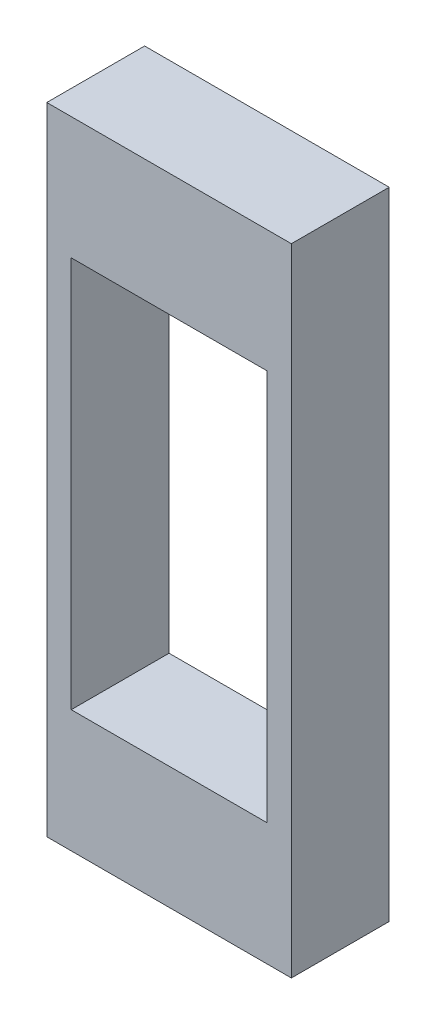
ISO-10303-21;
HEADER;
FILE_DESCRIPTION(('STEP AP214'),'2;1');
FILE_NAME('part.step','',(''),(''),'','','');
FILE_SCHEMA(('AUTOMOTIVE_DESIGN { 1 0 10303 214 1 1 1 1 }'));
ENDSEC;
DATA;
#1=APPLICATION_CONTEXT('core data for automotive mechanical design processes');
#2=APPLICATION_PROTOCOL_DEFINITION('international standard','automotive_design',2000,#1);
#3=PRODUCT_CONTEXT('',#1,'mechanical');
#4=PRODUCT('Part','Part','',(#3));
#5=PRODUCT_RELATED_PRODUCT_CATEGORY('part','',(#4));
#6=PRODUCT_DEFINITION_FORMATION('','',#4);
#7=PRODUCT_DEFINITION_CONTEXT('part definition',#1,'design');
#8=PRODUCT_DEFINITION('design','',#6,#7);
#9=PRODUCT_DEFINITION_SHAPE('','',#8);
#10=(LENGTH_UNIT() NAMED_UNIT(*) SI_UNIT(.MILLI.,.METRE.));
#11=(NAMED_UNIT(*) PLANE_ANGLE_UNIT() SI_UNIT($,.RADIAN.));
#12=(NAMED_UNIT(*) SI_UNIT($,.STERADIAN.) SOLID_ANGLE_UNIT());
#13=UNCERTAINTY_MEASURE_WITH_UNIT(LENGTH_MEASURE(1.E-05),#10,'distance_accuracy_value','');
#14=(GEOMETRIC_REPRESENTATION_CONTEXT(3) GLOBAL_UNCERTAINTY_ASSIGNED_CONTEXT((#13)) GLOBAL_UNIT_ASSIGNED_CONTEXT((#10,
#11,#12)) REPRESENTATION_CONTEXT('',''));
#15=CARTESIAN_POINT('',(0.,0.,0.));
#16=DIRECTION('',(0.,0.,1.));
#17=DIRECTION('',(1.,0.,0.));
#18=AXIS2_PLACEMENT_3D('',#15,#16,#17);
#19=CARTESIAN_POINT('',(-12.7,-33.02,10.16));
#20=DIRECTION('',(0.,0.,-1.));
#21=DIRECTION('',(-1.,0.,0.));
#22=AXIS2_PLACEMENT_3D('',#19,#20,#21);
#23=PLANE('',#22);
#24=DIRECTION('',(0.,-1.,0.));
#25=VECTOR('',#24,1.);
#26=CARTESIAN_POINT('',(-12.7,33.02,10.16));
#27=LINE('',#26,#25);
#28=CARTESIAN_POINT('',(-12.7,33.02,10.16));
#29=VERTEX_POINT('',#28);
#30=CARTESIAN_POINT('',(-12.7,-33.02,10.16));
#31=VERTEX_POINT('',#30);
#32=EDGE_CURVE('E136',#29,#31,#27,.T.);
#33=ORIENTED_EDGE('',*,*,#32,.T.);
#34=DIRECTION('',(1.,0.,0.));
#35=VECTOR('',#34,1.);
#36=CARTESIAN_POINT('',(12.7,-33.02,10.16));
#37=LINE('',#36,#35);
#38=CARTESIAN_POINT('',(12.7,-33.02,10.16));
#39=VERTEX_POINT('',#38);
#40=EDGE_CURVE('E139',#31,#39,#37,.T.);
#41=ORIENTED_EDGE('',*,*,#40,.T.);
#42=DIRECTION('',(0.,1.,0.));
#43=VECTOR('',#42,1.);
#44=CARTESIAN_POINT('',(12.7,33.02,10.16));
#45=LINE('',#44,#43);
#46=CARTESIAN_POINT('',(12.7,33.02,10.16));
#47=VERTEX_POINT('',#46);
#48=EDGE_CURVE('E142',#39,#47,#45,.T.);
#49=ORIENTED_EDGE('',*,*,#48,.T.);
#50=DIRECTION('',(-1.,0.,0.));
#51=VECTOR('',#50,1.);
#52=CARTESIAN_POINT('',(12.7,33.02,10.16));
#53=LINE('',#52,#51);
#54=EDGE_CURVE('E144',#47,#29,#53,.T.);
#55=ORIENTED_EDGE('',*,*,#54,.T.);
#56=EDGE_LOOP('',(#33,#41,#49,#55));
#57=FACE_BOUND('',#56,.T.);
#58=DIRECTION('',(0.,-1.,0.));
#59=VECTOR('',#58,1.);
#60=CARTESIAN_POINT('',(-10.16,20.32,10.16));
#61=LINE('',#60,#59);
#62=CARTESIAN_POINT('',(-10.16,20.32,10.16));
#63=VERTEX_POINT('',#62);
#64=CARTESIAN_POINT('',(-10.16,-20.32,10.16));
#65=VERTEX_POINT('',#64);
#66=EDGE_CURVE('E100',#63,#65,#61,.T.);
#67=ORIENTED_EDGE('',*,*,#66,.F.);
#68=DIRECTION('',(-1.,0.,0.));
#69=VECTOR('',#68,1.);
#70=CARTESIAN_POINT('',(10.16,20.32,10.16));
#71=LINE('',#70,#69);
#72=CARTESIAN_POINT('',(10.16,20.32,10.16));
#73=VERTEX_POINT('',#72);
#74=EDGE_CURVE('E122',#73,#63,#71,.T.);
#75=ORIENTED_EDGE('',*,*,#74,.F.);
#76=DIRECTION('',(0.,1.,0.));
#77=VECTOR('',#76,1.);
#78=CARTESIAN_POINT('',(10.16,20.32,10.16));
#79=LINE('',#78,#77);
#80=CARTESIAN_POINT('',(10.16,-20.32,10.16));
#81=VERTEX_POINT('',#80);
#82=EDGE_CURVE('E120',#81,#73,#79,.T.);
#83=ORIENTED_EDGE('',*,*,#82,.F.);
#84=DIRECTION('',(1.,0.,0.));
#85=VECTOR('',#84,1.);
#86=CARTESIAN_POINT('',(10.16,-20.32,10.16));
#87=LINE('',#86,#85);
#88=EDGE_CURVE('E108',#65,#81,#87,.T.);
#89=ORIENTED_EDGE('',*,*,#88,.F.);
#90=EDGE_LOOP('',(#67,#75,#83,#89));
#91=FACE_BOUND('',#90,.T.);
#92=ADVANCED_FACE('F35',(#57,#91),#23,.F.);
#93=CARTESIAN_POINT('',(-12.7,-33.02,0.));
#94=DIRECTION('',(0.,0.,-1.));
#95=DIRECTION('',(-1.,0.,0.));
#96=AXIS2_PLACEMENT_3D('',#93,#94,#95);
#97=PLANE('',#96);
#98=DIRECTION('',(0.,-1.,0.));
#99=VECTOR('',#98,1.);
#100=CARTESIAN_POINT('',(-12.7,33.02,0.));
#101=LINE('',#100,#99);
#102=CARTESIAN_POINT('',(-12.7,33.02,0.));
#103=VERTEX_POINT('',#102);
#104=CARTESIAN_POINT('',(-12.7,-33.02,0.));
#105=VERTEX_POINT('',#104);
#106=EDGE_CURVE('E116',#103,#105,#101,.T.);
#107=ORIENTED_EDGE('',*,*,#106,.F.);
#108=DIRECTION('',(-1.,0.,0.));
#109=VECTOR('',#108,1.);
#110=CARTESIAN_POINT('',(12.7,33.02,0.));
#111=LINE('',#110,#109);
#112=CARTESIAN_POINT('',(12.7,33.02,0.));
#113=VERTEX_POINT('',#112);
#114=EDGE_CURVE('E140',#113,#103,#111,.T.);
#115=ORIENTED_EDGE('',*,*,#114,.F.);
#116=DIRECTION('',(0.,1.,0.));
#117=VECTOR('',#116,1.);
#118=CARTESIAN_POINT('',(12.7,33.02,0.));
#119=LINE('',#118,#117);
#120=CARTESIAN_POINT('',(12.7,-33.02,0.));
#121=VERTEX_POINT('',#120);
#122=EDGE_CURVE('E151',#121,#113,#119,.T.);
#123=ORIENTED_EDGE('',*,*,#122,.F.);
#124=DIRECTION('',(1.,0.,0.));
#125=VECTOR('',#124,1.);
#126=CARTESIAN_POINT('',(12.7,-33.02,0.));
#127=LINE('',#126,#125);
#128=EDGE_CURVE('E149',#105,#121,#127,.T.);
#129=ORIENTED_EDGE('',*,*,#128,.F.);
#130=EDGE_LOOP('',(#107,#115,#123,#129));
#131=FACE_BOUND('',#130,.T.);
#132=DIRECTION('',(-1.,0.,0.));
#133=VECTOR('',#132,1.);
#134=CARTESIAN_POINT('',(10.16,20.32,0.));
#135=LINE('',#134,#133);
#136=CARTESIAN_POINT('',(10.16,20.32,0.));
#137=VERTEX_POINT('',#136);
#138=CARTESIAN_POINT('',(-10.16,20.32,0.));
#139=VERTEX_POINT('',#138);
#140=EDGE_CURVE('E109',#137,#139,#135,.T.);
#141=ORIENTED_EDGE('',*,*,#140,.T.);
#142=DIRECTION('',(0.,-1.,0.));
#143=VECTOR('',#142,1.);
#144=CARTESIAN_POINT('',(-10.16,20.32,0.));
#145=LINE('',#144,#143);
#146=CARTESIAN_POINT('',(-10.16,-20.32,0.));
#147=VERTEX_POINT('',#146);
#148=EDGE_CURVE('E58',#139,#147,#145,.T.);
#149=ORIENTED_EDGE('',*,*,#148,.T.);
#150=DIRECTION('',(1.,0.,0.));
#151=VECTOR('',#150,1.);
#152=CARTESIAN_POINT('',(10.16,-20.32,0.));
#153=LINE('',#152,#151);
#154=CARTESIAN_POINT('',(10.16,-20.32,0.));
#155=VERTEX_POINT('',#154);
#156=EDGE_CURVE('E115',#147,#155,#153,.T.);
#157=ORIENTED_EDGE('',*,*,#156,.T.);
#158=DIRECTION('',(0.,1.,0.));
#159=VECTOR('',#158,1.);
#160=CARTESIAN_POINT('',(10.16,20.32,0.));
#161=LINE('',#160,#159);
#162=EDGE_CURVE('E128',#155,#137,#161,.T.);
#163=ORIENTED_EDGE('',*,*,#162,.T.);
#164=EDGE_LOOP('',(#141,#149,#157,#163));
#165=FACE_BOUND('',#164,.T.);
#166=ADVANCED_FACE('F169',(#131,#165),#97,.T.);
#167=CARTESIAN_POINT('',(-12.7,33.02,10.16));
#168=DIRECTION('',(1.,0.,0.));
#169=DIRECTION('',(0.,1.,0.));
#170=AXIS2_PLACEMENT_3D('',#167,#168,#169);
#171=PLANE('',#170);
#172=ORIENTED_EDGE('',*,*,#106,.T.);
#173=DIRECTION('',(0.,0.,-1.));
#174=VECTOR('',#173,1.);
#175=CARTESIAN_POINT('',(-12.7,-33.02,10.16));
#176=LINE('',#175,#174);
#177=EDGE_CURVE('E11',#31,#105,#176,.T.);
#178=ORIENTED_EDGE('',*,*,#177,.F.);
#179=ORIENTED_EDGE('',*,*,#32,.F.);
#180=DIRECTION('',(0.,0.,-1.));
#181=VECTOR('',#180,1.);
#182=CARTESIAN_POINT('',(-12.7,33.02,10.16));
#183=LINE('',#182,#181);
#184=EDGE_CURVE('E146',#29,#103,#183,.T.);
#185=ORIENTED_EDGE('',*,*,#184,.T.);
#186=EDGE_LOOP('',(#172,#178,#179,#185));
#187=FACE_BOUND('',#186,.T.);
#188=ADVANCED_FACE('F37',(#187),#171,.F.);
#189=CARTESIAN_POINT('',(12.7,-33.02,10.16));
#190=DIRECTION('',(0.,1.,0.));
#191=DIRECTION('',(0.,0.,1.));
#192=AXIS2_PLACEMENT_3D('',#189,#190,#191);
#193=PLANE('',#192);
#194=ORIENTED_EDGE('',*,*,#128,.T.);
#195=DIRECTION('',(0.,0.,-1.));
#196=VECTOR('',#195,1.);
#197=CARTESIAN_POINT('',(12.7,-33.02,10.16));
#198=LINE('',#197,#196);
#199=EDGE_CURVE('E43',#39,#121,#198,.T.);
#200=ORIENTED_EDGE('',*,*,#199,.F.);
#201=ORIENTED_EDGE('',*,*,#40,.F.);
#202=ORIENTED_EDGE('',*,*,#177,.T.);
#203=EDGE_LOOP('',(#194,#200,#201,#202));
#204=FACE_BOUND('',#203,.T.);
#205=ADVANCED_FACE('F179',(#204),#193,.F.);
#206=CARTESIAN_POINT('',(12.7,33.02,10.16));
#207=DIRECTION('',(-1.,0.,0.));
#208=DIRECTION('',(0.,-1.,0.));
#209=AXIS2_PLACEMENT_3D('',#206,#207,#208);
#210=PLANE('',#209);
#211=ORIENTED_EDGE('',*,*,#122,.T.);
#212=DIRECTION('',(0.,0.,-1.));
#213=VECTOR('',#212,1.);
#214=CARTESIAN_POINT('',(12.7,33.02,10.16));
#215=LINE('',#214,#213);
#216=EDGE_CURVE('E156',#47,#113,#215,.T.);
#217=ORIENTED_EDGE('',*,*,#216,.F.);
#218=ORIENTED_EDGE('',*,*,#48,.F.);
#219=ORIENTED_EDGE('',*,*,#199,.T.);
#220=EDGE_LOOP('',(#211,#217,#218,#219));
#221=FACE_BOUND('',#220,.T.);
#222=ADVANCED_FACE('F163',(#221),#210,.F.);
#223=CARTESIAN_POINT('',(12.7,33.02,10.16));
#224=DIRECTION('',(0.,-1.,0.));
#225=DIRECTION('',(1.,0.,0.));
#226=AXIS2_PLACEMENT_3D('',#223,#224,#225);
#227=PLANE('',#226);
#228=ORIENTED_EDGE('',*,*,#114,.T.);
#229=ORIENTED_EDGE('',*,*,#184,.F.);
#230=ORIENTED_EDGE('',*,*,#54,.F.);
#231=ORIENTED_EDGE('',*,*,#216,.T.);
#232=EDGE_LOOP('',(#228,#229,#230,#231));
#233=FACE_BOUND('',#232,.T.);
#234=ADVANCED_FACE('F173',(#233),#227,.F.);
#235=CARTESIAN_POINT('',(-10.16,20.32,10.16));
#236=DIRECTION('',(1.,0.,0.));
#237=DIRECTION('',(0.,1.,0.));
#238=AXIS2_PLACEMENT_3D('',#235,#236,#237);
#239=PLANE('',#238);
#240=ORIENTED_EDGE('',*,*,#148,.F.);
#241=DIRECTION('',(0.,0.,-1.));
#242=VECTOR('',#241,1.);
#243=CARTESIAN_POINT('',(-10.16,20.32,10.16));
#244=LINE('',#243,#242);
#245=EDGE_CURVE('E104',#63,#139,#244,.T.);
#246=ORIENTED_EDGE('',*,*,#245,.F.);
#247=ORIENTED_EDGE('',*,*,#66,.T.);
#248=DIRECTION('',(0.,0.,-1.));
#249=VECTOR('',#248,1.);
#250=CARTESIAN_POINT('',(-10.16,-20.32,10.16));
#251=LINE('',#250,#249);
#252=EDGE_CURVE('E103',#65,#147,#251,.T.);
#253=ORIENTED_EDGE('',*,*,#252,.T.);
#254=EDGE_LOOP('',(#240,#246,#247,#253));
#255=FACE_BOUND('',#254,.T.);
#256=ADVANCED_FACE('F102',(#255),#239,.T.);
#257=CARTESIAN_POINT('',(10.16,-20.32,10.16));
#258=DIRECTION('',(0.,1.,0.));
#259=DIRECTION('',(-1.,0.,0.));
#260=AXIS2_PLACEMENT_3D('',#257,#258,#259);
#261=PLANE('',#260);
#262=ORIENTED_EDGE('',*,*,#156,.F.);
#263=ORIENTED_EDGE('',*,*,#252,.F.);
#264=ORIENTED_EDGE('',*,*,#88,.T.);
#265=DIRECTION('',(0.,0.,-1.));
#266=VECTOR('',#265,1.);
#267=CARTESIAN_POINT('',(10.16,-20.32,10.16));
#268=LINE('',#267,#266);
#269=EDGE_CURVE('E117',#81,#155,#268,.T.);
#270=ORIENTED_EDGE('',*,*,#269,.T.);
#271=EDGE_LOOP('',(#262,#263,#264,#270));
#272=FACE_BOUND('',#271,.T.);
#273=ADVANCED_FACE('F112',(#272),#261,.T.);
#274=CARTESIAN_POINT('',(10.16,20.32,10.16));
#275=DIRECTION('',(-1.,0.,0.));
#276=DIRECTION('',(0.,-1.,0.));
#277=AXIS2_PLACEMENT_3D('',#274,#275,#276);
#278=PLANE('',#277);
#279=ORIENTED_EDGE('',*,*,#162,.F.);
#280=ORIENTED_EDGE('',*,*,#269,.F.);
#281=ORIENTED_EDGE('',*,*,#82,.T.);
#282=DIRECTION('',(0.,0.,-1.));
#283=VECTOR('',#282,1.);
#284=CARTESIAN_POINT('',(10.16,20.32,10.16));
#285=LINE('',#284,#283);
#286=EDGE_CURVE('E50',#73,#137,#285,.T.);
#287=ORIENTED_EDGE('',*,*,#286,.T.);
#288=EDGE_LOOP('',(#279,#280,#281,#287));
#289=FACE_BOUND('',#288,.T.);
#290=ADVANCED_FACE('F202',(#289),#278,.T.);
#291=CARTESIAN_POINT('',(10.16,20.32,10.16));
#292=DIRECTION('',(0.,-1.,0.));
#293=DIRECTION('',(1.,0.,0.));
#294=AXIS2_PLACEMENT_3D('',#291,#292,#293);
#295=PLANE('',#294);
#296=ORIENTED_EDGE('',*,*,#140,.F.);
#297=ORIENTED_EDGE('',*,*,#286,.F.);
#298=ORIENTED_EDGE('',*,*,#74,.T.);
#299=ORIENTED_EDGE('',*,*,#245,.T.);
#300=EDGE_LOOP('',(#296,#297,#298,#299));
#301=FACE_BOUND('',#300,.T.);
#302=ADVANCED_FACE('F206',(#301),#295,.T.);
#303=CLOSED_SHELL('',(#92,#166,#188,#205,#222,#234,#256,#273,#290,#302));
#304=MANIFOLD_SOLID_BREP('B2',#303);
#305=ADVANCED_BREP_SHAPE_REPRESENTATION('',(#18,#304),#14);
#306=SHAPE_DEFINITION_REPRESENTATION(#9,#305);
ENDSEC;
END-ISO-10303-21;
